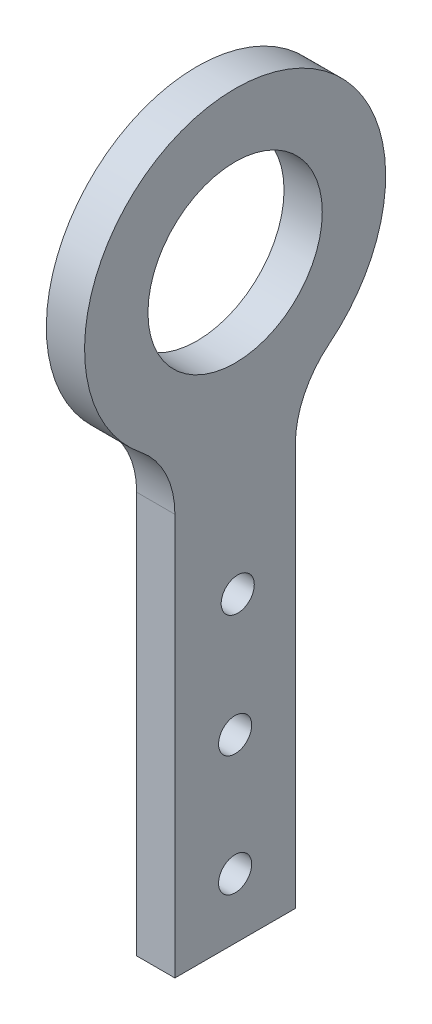
ISO-10303-21;
HEADER;
FILE_DESCRIPTION(('STEP AP214'),'2;1');
FILE_NAME('part.step','',(''),(''),'','','');
FILE_SCHEMA(('AUTOMOTIVE_DESIGN { 1 0 10303 214 1 1 1 1 }'));
ENDSEC;
DATA;
#1=APPLICATION_CONTEXT('core data for automotive mechanical design processes');
#2=APPLICATION_PROTOCOL_DEFINITION('international standard','automotive_design',2000,#1);
#3=PRODUCT_CONTEXT('',#1,'mechanical');
#4=PRODUCT('Part','Part','',(#3));
#5=PRODUCT_RELATED_PRODUCT_CATEGORY('part','',(#4));
#6=PRODUCT_DEFINITION_FORMATION('','',#4);
#7=PRODUCT_DEFINITION_CONTEXT('part definition',#1,'design');
#8=PRODUCT_DEFINITION('design','',#6,#7);
#9=PRODUCT_DEFINITION_SHAPE('','',#8);
#10=(LENGTH_UNIT() NAMED_UNIT(*) SI_UNIT(.MILLI.,.METRE.));
#11=(NAMED_UNIT(*) PLANE_ANGLE_UNIT() SI_UNIT($,.RADIAN.));
#12=(NAMED_UNIT(*) SI_UNIT($,.STERADIAN.) SOLID_ANGLE_UNIT());
#13=UNCERTAINTY_MEASURE_WITH_UNIT(LENGTH_MEASURE(1.E-05),#10,'distance_accuracy_value','');
#14=(GEOMETRIC_REPRESENTATION_CONTEXT(3) GLOBAL_UNCERTAINTY_ASSIGNED_CONTEXT((#13)) GLOBAL_UNIT_ASSIGNED_CONTEXT((#10,
#11,#12)) REPRESENTATION_CONTEXT('',''));
#15=CARTESIAN_POINT('',(0.,0.,0.));
#16=DIRECTION('',(0.,0.,1.));
#17=DIRECTION('',(1.,0.,0.));
#18=AXIS2_PLACEMENT_3D('',#15,#16,#17);
#19=CARTESIAN_POINT('',(6.35,0.,0.));
#20=DIRECTION('',(1.,0.,0.));
#21=DIRECTION('',(0.,0.,-1.));
#22=AXIS2_PLACEMENT_3D('',#19,#20,#21);
#23=PLANE('',#22);
#24=CARTESIAN_POINT('',(6.35,-87.9128784747792,0.));
#25=DIRECTION('',(1.,0.,0.));
#26=DIRECTION('',(0.,0.,-1.));
#27=AXIS2_PLACEMENT_3D('',#24,#25,#26);
#28=CIRCLE('',#27,2.75);
#29=CARTESIAN_POINT('',(6.35,-87.9128784747792,-2.75));
#30=VERTEX_POINT('',#29);
#31=EDGE_CURVE('E268',#30,#30,#28,.T.);
#32=ORIENTED_EDGE('',*,*,#31,.F.);
#33=EDGE_LOOP('',(#32));
#34=FACE_BOUND('',#33,.T.);
#35=CARTESIAN_POINT('',(6.35,-67.9128784747792,0.));
#36=DIRECTION('',(1.,0.,0.));
#37=DIRECTION('',(0.,0.,-1.));
#38=AXIS2_PLACEMENT_3D('',#35,#36,#37);
#39=CIRCLE('',#38,2.75);
#40=CARTESIAN_POINT('',(6.35,-67.9128784747792,-2.75));
#41=VERTEX_POINT('',#40);
#42=EDGE_CURVE('E267',#41,#41,#39,.T.);
#43=ORIENTED_EDGE('',*,*,#42,.F.);
#44=EDGE_LOOP('',(#43));
#45=FACE_BOUND('',#44,.T.);
#46=CARTESIAN_POINT('',(6.35,-47.9128784747792,-0.431184647680993));
#47=DIRECTION('',(1.,0.,0.));
#48=DIRECTION('',(0.,0.,-1.));
#49=AXIS2_PLACEMENT_3D('',#46,#47,#48);
#50=CIRCLE('',#49,2.75);
#51=CARTESIAN_POINT('',(6.35,-47.9128784747792,-3.18118464768099));
#52=VERTEX_POINT('',#51);
#53=EDGE_CURVE('E273',#52,#52,#50,.T.);
#54=ORIENTED_EDGE('',*,*,#53,.F.);
#55=EDGE_LOOP('',(#54));
#56=FACE_BOUND('',#55,.T.);
#57=DIRECTION('',(0.,0.,-1.));
#58=VECTOR('',#57,1.);
#59=CARTESIAN_POINT('',(6.35,-97.9128784747792,10.));
#60=LINE('',#59,#58);
#61=CARTESIAN_POINT('',(6.35,-97.9128784747792,10.));
#62=VERTEX_POINT('',#61);
#63=CARTESIAN_POINT('',(6.35,-97.9128784747792,-10.));
#64=VERTEX_POINT('',#63);
#65=EDGE_CURVE('E104',#62,#64,#60,.T.);
#66=ORIENTED_EDGE('',*,*,#65,.T.);
#67=DIRECTION('',(0.,1.,0.));
#68=VECTOR('',#67,1.);
#69=CARTESIAN_POINT('',(6.35,-97.9128784747792,-10.));
#70=LINE('',#69,#68);
#71=CARTESIAN_POINT('',(6.35,-31.224989991992,-10.));
#72=VERTEX_POINT('',#71);
#73=EDGE_CURVE('E93',#64,#72,#70,.T.);
#74=ORIENTED_EDGE('',*,*,#73,.T.);
#75=CARTESIAN_POINT('',(6.35,-31.224989991992,-25.));
#76=DIRECTION('',(1.,0.,0.));
#77=DIRECTION('',(0.,0.,-1.));
#78=AXIS2_PLACEMENT_3D('',#75,#76,#77);
#79=CIRCLE('',#78,15.);
#80=CARTESIAN_POINT('',(6.35,-19.515618744995,-15.625));
#81=VERTEX_POINT('',#80);
#82=EDGE_CURVE('E132',#72,#81,#79,.F.);
#83=ORIENTED_EDGE('',*,*,#82,.T.);
#84=CARTESIAN_POINT('',(6.35,0.,0.));
#85=DIRECTION('',(1.,0.,0.));
#86=DIRECTION('',(0.,0.,-1.));
#87=AXIS2_PLACEMENT_3D('',#84,#85,#86);
#88=CIRCLE('',#87,25.);
#89=CARTESIAN_POINT('',(6.35,-19.515618744995,15.625));
#90=VERTEX_POINT('',#89);
#91=EDGE_CURVE('E103',#81,#90,#88,.T.);
#92=ORIENTED_EDGE('',*,*,#91,.T.);
#93=CARTESIAN_POINT('',(6.35,-31.224989991992,25.));
#94=DIRECTION('',(1.,0.,0.));
#95=DIRECTION('',(0.,0.,-1.));
#96=AXIS2_PLACEMENT_3D('',#93,#94,#95);
#97=CIRCLE('',#96,15.);
#98=CARTESIAN_POINT('',(6.35,-31.224989991992,10.));
#99=VERTEX_POINT('',#98);
#100=EDGE_CURVE('E11',#90,#99,#97,.F.);
#101=ORIENTED_EDGE('',*,*,#100,.T.);
#102=DIRECTION('',(0.,-1.,0.));
#103=VECTOR('',#102,1.);
#104=CARTESIAN_POINT('',(6.35,-22.9128784747792,10.));
#105=LINE('',#104,#103);
#106=EDGE_CURVE('E108',#99,#62,#105,.T.);
#107=ORIENTED_EDGE('',*,*,#106,.T.);
#108=EDGE_LOOP('',(#66,#74,#83,#92,#101,#107));
#109=FACE_BOUND('',#108,.T.);
#110=CARTESIAN_POINT('',(6.35,0.,0.));
#111=DIRECTION('',(1.,0.,0.));
#112=DIRECTION('',(0.,0.,-1.));
#113=AXIS2_PLACEMENT_3D('',#110,#111,#112);
#114=CIRCLE('',#113,14.475);
#115=CARTESIAN_POINT('',(6.35,0.,-14.475));
#116=VERTEX_POINT('',#115);
#117=EDGE_CURVE('E152',#116,#116,#114,.T.);
#118=ORIENTED_EDGE('',*,*,#117,.F.);
#119=EDGE_LOOP('',(#118));
#120=FACE_BOUND('',#119,.T.);
#121=ADVANCED_FACE('F41',(#34,#45,#56,#109,#120),#23,.T.);
#122=CARTESIAN_POINT('',(0.,0.,0.));
#123=DIRECTION('',(1.,0.,0.));
#124=DIRECTION('',(0.,0.,-1.));
#125=AXIS2_PLACEMENT_3D('',#122,#123,#124);
#126=PLANE('',#125);
#127=CARTESIAN_POINT('',(0.,-87.9128784747792,0.));
#128=DIRECTION('',(1.,0.,0.));
#129=DIRECTION('',(0.,0.,-1.));
#130=AXIS2_PLACEMENT_3D('',#127,#128,#129);
#131=CIRCLE('',#130,2.75);
#132=CARTESIAN_POINT('',(0.,-87.9128784747792,-2.75));
#133=VERTEX_POINT('',#132);
#134=EDGE_CURVE('E271',#133,#133,#131,.T.);
#135=ORIENTED_EDGE('',*,*,#134,.T.);
#136=EDGE_LOOP('',(#135));
#137=FACE_BOUND('',#136,.T.);
#138=CARTESIAN_POINT('',(0.,-67.9128784747792,0.));
#139=DIRECTION('',(1.,0.,0.));
#140=DIRECTION('',(0.,0.,-1.));
#141=AXIS2_PLACEMENT_3D('',#138,#139,#140);
#142=CIRCLE('',#141,2.75);
#143=CARTESIAN_POINT('',(0.,-67.9128784747792,-2.75));
#144=VERTEX_POINT('',#143);
#145=EDGE_CURVE('E264',#144,#144,#142,.T.);
#146=ORIENTED_EDGE('',*,*,#145,.T.);
#147=EDGE_LOOP('',(#146));
#148=FACE_BOUND('',#147,.T.);
#149=CARTESIAN_POINT('',(0.,-47.9128784747792,-0.431184647680993));
#150=DIRECTION('',(1.,0.,0.));
#151=DIRECTION('',(0.,0.,-1.));
#152=AXIS2_PLACEMENT_3D('',#149,#150,#151);
#153=CIRCLE('',#152,2.75);
#154=CARTESIAN_POINT('',(0.,-47.9128784747792,-3.18118464768099));
#155=VERTEX_POINT('',#154);
#156=EDGE_CURVE('E279',#155,#155,#153,.T.);
#157=ORIENTED_EDGE('',*,*,#156,.T.);
#158=EDGE_LOOP('',(#157));
#159=FACE_BOUND('',#158,.T.);
#160=DIRECTION('',(0.,0.,-1.));
#161=VECTOR('',#160,1.);
#162=CARTESIAN_POINT('',(0.,-97.9128784747792,10.));
#163=LINE('',#162,#161);
#164=CARTESIAN_POINT('',(0.,-97.9128784747792,10.));
#165=VERTEX_POINT('',#164);
#166=CARTESIAN_POINT('',(0.,-97.9128784747792,-10.));
#167=VERTEX_POINT('',#166);
#168=EDGE_CURVE('E116',#165,#167,#163,.T.);
#169=ORIENTED_EDGE('',*,*,#168,.F.);
#170=DIRECTION('',(0.,-1.,0.));
#171=VECTOR('',#170,1.);
#172=CARTESIAN_POINT('',(0.,-22.9128784747792,10.));
#173=LINE('',#172,#171);
#174=CARTESIAN_POINT('',(0.,-31.224989991992,10.));
#175=VERTEX_POINT('',#174);
#176=EDGE_CURVE('E112',#175,#165,#173,.T.);
#177=ORIENTED_EDGE('',*,*,#176,.F.);
#178=CARTESIAN_POINT('',(0.,-31.224989991992,25.));
#179=DIRECTION('',(1.,0.,0.));
#180=DIRECTION('',(0.,0.,-1.));
#181=AXIS2_PLACEMENT_3D('',#178,#179,#180);
#182=CIRCLE('',#181,15.);
#183=CARTESIAN_POINT('',(0.,-19.515618744995,15.625));
#184=VERTEX_POINT('',#183);
#185=EDGE_CURVE('E49',#175,#184,#182,.T.);
#186=ORIENTED_EDGE('',*,*,#185,.T.);
#187=CARTESIAN_POINT('',(0.,0.,0.));
#188=DIRECTION('',(1.,0.,0.));
#189=DIRECTION('',(0.,0.,-1.));
#190=AXIS2_PLACEMENT_3D('',#187,#188,#189);
#191=CIRCLE('',#190,25.);
#192=CARTESIAN_POINT('',(0.,-19.515618744995,-15.625));
#193=VERTEX_POINT('',#192);
#194=EDGE_CURVE('E139',#193,#184,#191,.T.);
#195=ORIENTED_EDGE('',*,*,#194,.F.);
#196=CARTESIAN_POINT('',(0.,-31.224989991992,-25.));
#197=DIRECTION('',(1.,0.,0.));
#198=DIRECTION('',(0.,0.,-1.));
#199=AXIS2_PLACEMENT_3D('',#196,#197,#198);
#200=CIRCLE('',#199,15.);
#201=CARTESIAN_POINT('',(0.,-31.224989991992,-10.));
#202=VERTEX_POINT('',#201);
#203=EDGE_CURVE('E130',#193,#202,#200,.T.);
#204=ORIENTED_EDGE('',*,*,#203,.T.);
#205=DIRECTION('',(0.,1.,0.));
#206=VECTOR('',#205,1.);
#207=CARTESIAN_POINT('',(0.,-97.9128784747792,-10.));
#208=LINE('',#207,#206);
#209=EDGE_CURVE('E144',#167,#202,#208,.T.);
#210=ORIENTED_EDGE('',*,*,#209,.F.);
#211=EDGE_LOOP('',(#169,#177,#186,#195,#204,#210));
#212=FACE_BOUND('',#211,.T.);
#213=CARTESIAN_POINT('',(0.,0.,0.));
#214=DIRECTION('',(1.,0.,0.));
#215=DIRECTION('',(0.,0.,-1.));
#216=AXIS2_PLACEMENT_3D('',#213,#214,#215);
#217=CIRCLE('',#216,14.475);
#218=CARTESIAN_POINT('',(0.,0.,-14.475));
#219=VERTEX_POINT('',#218);
#220=EDGE_CURVE('E284',#219,#219,#217,.T.);
#221=ORIENTED_EDGE('',*,*,#220,.T.);
#222=EDGE_LOOP('',(#221));
#223=FACE_BOUND('',#222,.T.);
#224=ADVANCED_FACE('F137',(#137,#148,#159,#212,#223),#126,.F.);
#225=CARTESIAN_POINT('',(6.35,-97.9128784747792,10.));
#226=DIRECTION('',(0.,1.,0.));
#227=DIRECTION('',(0.,0.,1.));
#228=AXIS2_PLACEMENT_3D('',#225,#226,#227);
#229=PLANE('',#228);
#230=ORIENTED_EDGE('',*,*,#168,.T.);
#231=DIRECTION('',(-1.,0.,0.));
#232=VECTOR('',#231,1.);
#233=CARTESIAN_POINT('',(6.35,-97.9128784747792,-10.));
#234=LINE('',#233,#232);
#235=EDGE_CURVE('E98',#64,#167,#234,.T.);
#236=ORIENTED_EDGE('',*,*,#235,.F.);
#237=ORIENTED_EDGE('',*,*,#65,.F.);
#238=DIRECTION('',(-1.,0.,0.));
#239=VECTOR('',#238,1.);
#240=CARTESIAN_POINT('',(6.35,-97.9128784747792,10.));
#241=LINE('',#240,#239);
#242=EDGE_CURVE('E118',#62,#165,#241,.T.);
#243=ORIENTED_EDGE('',*,*,#242,.T.);
#244=EDGE_LOOP('',(#230,#236,#237,#243));
#245=FACE_BOUND('',#244,.T.);
#246=ADVANCED_FACE('F114',(#245),#229,.F.);
#247=CARTESIAN_POINT('',(6.35,-97.9128784747792,-10.));
#248=DIRECTION('',(0.,0.,1.));
#249=DIRECTION('',(0.,-1.,0.));
#250=AXIS2_PLACEMENT_3D('',#247,#248,#249);
#251=PLANE('',#250);
#252=ORIENTED_EDGE('',*,*,#209,.T.);
#253=DIRECTION('',(1.,0.,0.));
#254=VECTOR('',#253,1.);
#255=CARTESIAN_POINT('',(6.35,-31.224989991992,-10.));
#256=LINE('',#255,#254);
#257=EDGE_CURVE('E101',#202,#72,#256,.T.);
#258=ORIENTED_EDGE('',*,*,#257,.T.);
#259=ORIENTED_EDGE('',*,*,#73,.F.);
#260=ORIENTED_EDGE('',*,*,#235,.T.);
#261=EDGE_LOOP('',(#252,#258,#259,#260));
#262=FACE_BOUND('',#261,.T.);
#263=ADVANCED_FACE('F96',(#262),#251,.F.);
#264=CARTESIAN_POINT('',(6.35,0.,0.));
#265=DIRECTION('',(-1.,0.,0.));
#266=DIRECTION('',(0.,0.,1.));
#267=AXIS2_PLACEMENT_3D('',#264,#265,#266);
#268=CYLINDRICAL_SURFACE('',#267,25.);
#269=ORIENTED_EDGE('',*,*,#91,.F.);
#270=DIRECTION('',(-1.,0.,0.));
#271=VECTOR('',#270,1.);
#272=CARTESIAN_POINT('',(6.35,-19.515618744995,-15.625));
#273=LINE('',#272,#271);
#274=EDGE_CURVE('E120',#81,#193,#273,.T.);
#275=ORIENTED_EDGE('',*,*,#274,.T.);
#276=ORIENTED_EDGE('',*,*,#194,.T.);
#277=DIRECTION('',(-1.,0.,0.));
#278=VECTOR('',#277,1.);
#279=CARTESIAN_POINT('',(6.35,-19.515618744995,15.625));
#280=LINE('',#279,#278);
#281=EDGE_CURVE('E117',#184,#90,#280,.F.);
#282=ORIENTED_EDGE('',*,*,#281,.T.);
#283=EDGE_LOOP('',(#269,#275,#276,#282));
#284=FACE_BOUND('',#283,.T.);
#285=ADVANCED_FACE('F142',(#284),#268,.T.);
#286=CARTESIAN_POINT('',(6.35,-22.9128784747792,10.));
#287=DIRECTION('',(0.,0.,-1.));
#288=DIRECTION('',(0.,1.,0.));
#289=AXIS2_PLACEMENT_3D('',#286,#287,#288);
#290=PLANE('',#289);
#291=ORIENTED_EDGE('',*,*,#106,.F.);
#292=DIRECTION('',(1.,0.,0.));
#293=VECTOR('',#292,1.);
#294=CARTESIAN_POINT('',(0.,-31.224989991992,10.));
#295=LINE('',#294,#293);
#296=EDGE_CURVE('E128',#99,#175,#295,.F.);
#297=ORIENTED_EDGE('',*,*,#296,.T.);
#298=ORIENTED_EDGE('',*,*,#176,.T.);
#299=ORIENTED_EDGE('',*,*,#242,.F.);
#300=EDGE_LOOP('',(#291,#297,#298,#299));
#301=FACE_BOUND('',#300,.T.);
#302=ADVANCED_FACE('F147',(#301),#290,.F.);
#303=CARTESIAN_POINT('',(6.35,0.,0.));
#304=DIRECTION('',(-1.,0.,0.));
#305=DIRECTION('',(0.,0.,1.));
#306=AXIS2_PLACEMENT_3D('',#303,#304,#305);
#307=CYLINDRICAL_SURFACE('',#306,14.475);
#308=ORIENTED_EDGE('',*,*,#117,.T.);
#309=EDGE_LOOP('',(#308));
#310=FACE_BOUND('',#309,.T.);
#311=ORIENTED_EDGE('',*,*,#220,.F.);
#312=EDGE_LOOP('',(#311));
#313=FACE_BOUND('',#312,.T.);
#314=ADVANCED_FACE('F177',(#310,#313),#307,.F.);
#315=CARTESIAN_POINT('',(0.,-47.9128784747792,-0.431184647680993));
#316=DIRECTION('',(1.,0.,0.));
#317=DIRECTION('',(0.,0.,-1.));
#318=AXIS2_PLACEMENT_3D('',#315,#316,#317);
#319=CYLINDRICAL_SURFACE('',#318,2.75);
#320=ORIENTED_EDGE('',*,*,#156,.F.);
#321=EDGE_LOOP('',(#320));
#322=FACE_BOUND('',#321,.T.);
#323=ORIENTED_EDGE('',*,*,#53,.T.);
#324=EDGE_LOOP('',(#323));
#325=FACE_BOUND('',#324,.T.);
#326=ADVANCED_FACE('F196',(#322,#325),#319,.F.);
#327=CARTESIAN_POINT('',(0.,-67.9128784747792,0.));
#328=DIRECTION('',(1.,0.,0.));
#329=DIRECTION('',(0.,0.,-1.));
#330=AXIS2_PLACEMENT_3D('',#327,#328,#329);
#331=CYLINDRICAL_SURFACE('',#330,2.75);
#332=ORIENTED_EDGE('',*,*,#145,.F.);
#333=EDGE_LOOP('',(#332));
#334=FACE_BOUND('',#333,.T.);
#335=ORIENTED_EDGE('',*,*,#42,.T.);
#336=EDGE_LOOP('',(#335));
#337=FACE_BOUND('',#336,.T.);
#338=ADVANCED_FACE('F162',(#334,#337),#331,.F.);
#339=CARTESIAN_POINT('',(0.,-87.9128784747792,0.));
#340=DIRECTION('',(1.,0.,0.));
#341=DIRECTION('',(0.,0.,-1.));
#342=AXIS2_PLACEMENT_3D('',#339,#340,#341);
#343=CYLINDRICAL_SURFACE('',#342,2.75);
#344=ORIENTED_EDGE('',*,*,#134,.F.);
#345=EDGE_LOOP('',(#344));
#346=FACE_BOUND('',#345,.T.);
#347=ORIENTED_EDGE('',*,*,#31,.T.);
#348=EDGE_LOOP('',(#347));
#349=FACE_BOUND('',#348,.T.);
#350=ADVANCED_FACE('F156',(#346,#349),#343,.F.);
#351=CARTESIAN_POINT('',(6.35,-31.224989991992,-25.));
#352=DIRECTION('',(-1.,0.,0.));
#353=DIRECTION('',(0.,0.,1.));
#354=AXIS2_PLACEMENT_3D('',#351,#352,#353);
#355=CYLINDRICAL_SURFACE('',#354,15.);
#356=ORIENTED_EDGE('',*,*,#82,.F.);
#357=ORIENTED_EDGE('',*,*,#257,.F.);
#358=ORIENTED_EDGE('',*,*,#203,.F.);
#359=ORIENTED_EDGE('',*,*,#274,.F.);
#360=EDGE_LOOP('',(#356,#357,#358,#359));
#361=FACE_BOUND('',#360,.T.);
#362=ADVANCED_FACE('F154',(#361),#355,.F.);
#363=CARTESIAN_POINT('',(6.35,-31.224989991992,25.));
#364=DIRECTION('',(-1.,0.,0.));
#365=DIRECTION('',(0.,0.,1.));
#366=AXIS2_PLACEMENT_3D('',#363,#364,#365);
#367=CYLINDRICAL_SURFACE('',#366,15.);
#368=ORIENTED_EDGE('',*,*,#100,.F.);
#369=ORIENTED_EDGE('',*,*,#281,.F.);
#370=ORIENTED_EDGE('',*,*,#185,.F.);
#371=ORIENTED_EDGE('',*,*,#296,.F.);
#372=EDGE_LOOP('',(#368,#369,#370,#371));
#373=FACE_BOUND('',#372,.T.);
#374=ADVANCED_FACE('F43',(#373),#367,.F.);
#375=CLOSED_SHELL('',(#121,#224,#246,#263,#285,#302,#314,#326,#338,#350,#362,#374));
#376=MANIFOLD_SOLID_BREP('B2',#375);
#377=ADVANCED_BREP_SHAPE_REPRESENTATION('',(#18,#376),#14);
#378=SHAPE_DEFINITION_REPRESENTATION(#9,#377);
ENDSEC;
END-ISO-10303-21;
